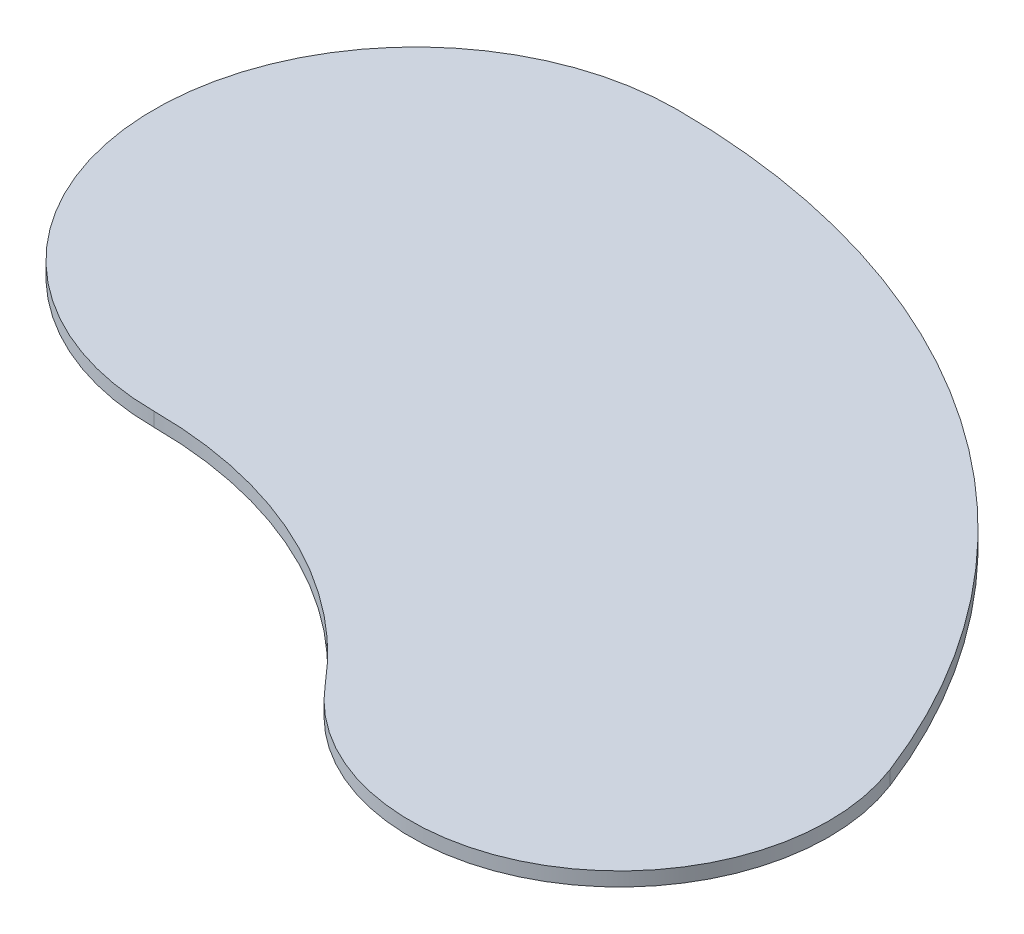
ISO-10303-21;
HEADER;
FILE_DESCRIPTION(('STEP AP214'),'2;1');
FILE_NAME('part.step','',(''),(''),'','','');
FILE_SCHEMA(('AUTOMOTIVE_DESIGN { 1 0 10303 214 1 1 1 1 }'));
ENDSEC;
DATA;
#1=APPLICATION_CONTEXT('core data for automotive mechanical design processes');
#2=APPLICATION_PROTOCOL_DEFINITION('international standard','automotive_design',2000,#1);
#3=PRODUCT_CONTEXT('',#1,'mechanical');
#4=PRODUCT('Part','Part','',(#3));
#5=PRODUCT_RELATED_PRODUCT_CATEGORY('part','',(#4));
#6=PRODUCT_DEFINITION_FORMATION('','',#4);
#7=PRODUCT_DEFINITION_CONTEXT('part definition',#1,'design');
#8=PRODUCT_DEFINITION('design','',#6,#7);
#9=PRODUCT_DEFINITION_SHAPE('','',#8);
#10=(LENGTH_UNIT() NAMED_UNIT(*) SI_UNIT(.MILLI.,.METRE.));
#11=(NAMED_UNIT(*) PLANE_ANGLE_UNIT() SI_UNIT($,.RADIAN.));
#12=(NAMED_UNIT(*) SI_UNIT($,.STERADIAN.) SOLID_ANGLE_UNIT());
#13=UNCERTAINTY_MEASURE_WITH_UNIT(LENGTH_MEASURE(1.E-05),#10,'distance_accuracy_value','');
#14=(GEOMETRIC_REPRESENTATION_CONTEXT(3) GLOBAL_UNCERTAINTY_ASSIGNED_CONTEXT((#13)) GLOBAL_UNIT_ASSIGNED_CONTEXT((#10,
#11,#12)) REPRESENTATION_CONTEXT('',''));
#15=CARTESIAN_POINT('',(0.,0.,0.));
#16=DIRECTION('',(0.,0.,1.));
#17=DIRECTION('',(1.,0.,0.));
#18=AXIS2_PLACEMENT_3D('',#15,#16,#17);
#19=CARTESIAN_POINT('',(0.,2.54,-16.7940789473687));
#20=DIRECTION('',(0.,-1.,0.));
#21=DIRECTION('',(0.,0.,-1.));
#22=AXIS2_PLACEMENT_3D('',#19,#20,#21);
#23=CYLINDRICAL_SURFACE('',#22,132.430921052631);
#24=CARTESIAN_POINT('',(0.,0.,-16.7940789473687));
#25=DIRECTION('',(0.,-1.,0.));
#26=DIRECTION('',(0.,0.,-1.));
#27=AXIS2_PLACEMENT_3D('',#24,#25,#26);
#28=CIRCLE('',#27,132.430921052631);
#29=CARTESIAN_POINT('',(0.,0.,-149.225));
#30=VERTEX_POINT('',#29);
#31=CARTESIAN_POINT('',(123.526365742985,0.,-64.5348981399474));
#32=VERTEX_POINT('',#31);
#33=EDGE_CURVE('E120',#30,#32,#28,.T.);
#34=ORIENTED_EDGE('',*,*,#33,.F.);
#35=DIRECTION('',(0.,-1.,0.));
#36=VECTOR('',#35,1.);
#37=CARTESIAN_POINT('',(0.,2.54,-149.225));
#38=LINE('',#37,#36);
#39=CARTESIAN_POINT('',(0.,2.54,-149.225));
#40=VERTEX_POINT('',#39);
#41=EDGE_CURVE('E12',#40,#30,#38,.T.);
#42=ORIENTED_EDGE('',*,*,#41,.F.);
#43=CARTESIAN_POINT('',(0.,2.54,-16.7940789473687));
#44=DIRECTION('',(0.,-1.,0.));
#45=DIRECTION('',(0.,0.,-1.));
#46=AXIS2_PLACEMENT_3D('',#43,#44,#45);
#47=CIRCLE('',#46,132.430921052631);
#48=CARTESIAN_POINT('',(123.526365742985,2.54,-64.5348981399474));
#49=VERTEX_POINT('',#48);
#50=EDGE_CURVE('E108',#40,#49,#47,.T.);
#51=ORIENTED_EDGE('',*,*,#50,.T.);
#52=DIRECTION('',(0.,-1.,0.));
#53=VECTOR('',#52,1.);
#54=CARTESIAN_POINT('',(123.526365742985,2.54,-64.5348981399474));
#55=LINE('',#54,#53);
#56=EDGE_CURVE('E47',#49,#32,#55,.T.);
#57=ORIENTED_EDGE('',*,*,#56,.T.);
#58=EDGE_LOOP('',(#34,#42,#51,#57));
#59=FACE_BOUND('',#58,.T.);
#60=ADVANCED_FACE('F44',(#59),#23,.T.);
#61=CARTESIAN_POINT('',(0.,2.54,-101.6));
#62=DIRECTION('',(0.,-1.,0.));
#63=DIRECTION('',(0.,0.,-1.));
#64=AXIS2_PLACEMENT_3D('',#61,#62,#63);
#65=CYLINDRICAL_SURFACE('',#64,47.625);
#66=CARTESIAN_POINT('',(0.,0.,-101.6));
#67=DIRECTION('',(0.,1.,0.));
#68=DIRECTION('',(0.,0.,1.));
#69=AXIS2_PLACEMENT_3D('',#66,#67,#68);
#70=CIRCLE('',#69,47.625);
#71=CARTESIAN_POINT('',(0.,0.,-53.975));
#72=VERTEX_POINT('',#71);
#73=EDGE_CURVE('E78',#30,#72,#70,.T.);
#74=ORIENTED_EDGE('',*,*,#73,.T.);
#75=DIRECTION('',(0.,-1.,0.));
#76=VECTOR('',#75,1.);
#77=CARTESIAN_POINT('',(0.,2.54,-53.975));
#78=LINE('',#77,#76);
#79=CARTESIAN_POINT('',(0.,2.54,-53.975));
#80=VERTEX_POINT('',#79);
#81=EDGE_CURVE('E54',#80,#72,#78,.T.);
#82=ORIENTED_EDGE('',*,*,#81,.F.);
#83=CARTESIAN_POINT('',(0.,2.54,-101.6));
#84=DIRECTION('',(0.,1.,0.));
#85=DIRECTION('',(0.,0.,1.));
#86=AXIS2_PLACEMENT_3D('',#83,#84,#85);
#87=CIRCLE('',#86,47.625);
#88=EDGE_CURVE('E93',#40,#80,#87,.T.);
#89=ORIENTED_EDGE('',*,*,#88,.F.);
#90=ORIENTED_EDGE('',*,*,#41,.T.);
#91=EDGE_LOOP('',(#74,#82,#89,#90));
#92=FACE_BOUND('',#91,.T.);
#93=ADVANCED_FACE('F136',(#92),#65,.T.);
#94=CARTESIAN_POINT('',(0.,2.54,22.3471153846156));
#95=DIRECTION('',(0.,-1.,0.));
#96=DIRECTION('',(0.,0.,-1.));
#97=AXIS2_PLACEMENT_3D('',#94,#95,#96);
#98=CYLINDRICAL_SURFACE('',#97,76.3221153846156);
#99=CARTESIAN_POINT('',(0.,0.,22.3471153846156));
#100=DIRECTION('',(0.,-1.,0.));
#101=DIRECTION('',(0.,0.,-1.));
#102=AXIS2_PLACEMENT_3D('',#99,#100,#101);
#103=CIRCLE('',#102,76.3221153846156);
#104=CARTESIAN_POINT('',(58.6900887303221,0.,-26.4436499466385));
#105=VERTEX_POINT('',#104);
#106=EDGE_CURVE('E101',#72,#105,#103,.T.);
#107=ORIENTED_EDGE('',*,*,#106,.T.);
#108=DIRECTION('',(0.,-1.,0.));
#109=VECTOR('',#108,1.);
#110=CARTESIAN_POINT('',(58.6900887303221,2.54,-26.4436499466385));
#111=LINE('',#110,#109);
#112=CARTESIAN_POINT('',(58.6900887303221,2.54,-26.4436499466385));
#113=VERTEX_POINT('',#112);
#114=EDGE_CURVE('E98',#113,#105,#111,.T.);
#115=ORIENTED_EDGE('',*,*,#114,.F.);
#116=CARTESIAN_POINT('',(0.,2.54,22.3471153846156));
#117=DIRECTION('',(0.,-1.,0.));
#118=DIRECTION('',(0.,0.,-1.));
#119=AXIS2_PLACEMENT_3D('',#116,#117,#118);
#120=CIRCLE('',#119,76.3221153846156);
#121=EDGE_CURVE('E90',#80,#113,#120,.T.);
#122=ORIENTED_EDGE('',*,*,#121,.F.);
#123=ORIENTED_EDGE('',*,*,#81,.T.);
#124=EDGE_LOOP('',(#107,#115,#122,#123));
#125=FACE_BOUND('',#124,.T.);
#126=ADVANCED_FACE('F99',(#125),#98,.F.);
#127=CARTESIAN_POINT('',(87.9881810244987,2.54,-50.8000000000005));
#128=DIRECTION('',(0.,-1.,0.));
#129=DIRECTION('',(0.,0.,-1.));
#130=AXIS2_PLACEMENT_3D('',#127,#128,#129);
#131=CYLINDRICAL_SURFACE('',#130,38.1);
#132=CARTESIAN_POINT('',(87.9881810244987,0.,-50.8000000000005));
#133=DIRECTION('',(0.,1.,0.));
#134=DIRECTION('',(0.,0.,1.));
#135=AXIS2_PLACEMENT_3D('',#132,#133,#134);
#136=CIRCLE('',#135,38.1);
#137=EDGE_CURVE('E124',#105,#32,#136,.T.);
#138=ORIENTED_EDGE('',*,*,#137,.T.);
#139=ORIENTED_EDGE('',*,*,#56,.F.);
#140=CARTESIAN_POINT('',(87.9881810244987,2.54,-50.8000000000005));
#141=DIRECTION('',(0.,1.,0.));
#142=DIRECTION('',(0.,0.,1.));
#143=AXIS2_PLACEMENT_3D('',#140,#141,#142);
#144=CIRCLE('',#143,38.1);
#145=EDGE_CURVE('E87',#113,#49,#144,.T.);
#146=ORIENTED_EDGE('',*,*,#145,.F.);
#147=ORIENTED_EDGE('',*,*,#114,.T.);
#148=EDGE_LOOP('',(#138,#139,#146,#147));
#149=FACE_BOUND('',#148,.T.);
#150=ADVANCED_FACE('F106',(#149),#131,.T.);
#151=CARTESIAN_POINT('',(43.9940905122494,2.54,-33.7970394736845));
#152=DIRECTION('',(0.,-1.,0.));
#153=DIRECTION('',(0.,0.,-1.));
#154=AXIS2_PLACEMENT_3D('',#151,#152,#153);
#155=PLANE('',#154);
#156=ORIENTED_EDGE('',*,*,#50,.F.);
#157=ORIENTED_EDGE('',*,*,#88,.T.);
#158=ORIENTED_EDGE('',*,*,#121,.T.);
#159=ORIENTED_EDGE('',*,*,#145,.T.);
#160=EDGE_LOOP('',(#156,#157,#158,#159));
#161=FACE_BOUND('',#160,.T.);
#162=ADVANCED_FACE('F92',(#161),#155,.F.);
#163=CARTESIAN_POINT('',(43.9940905122494,0.,-33.7970394736845));
#164=DIRECTION('',(0.,-1.,0.));
#165=DIRECTION('',(0.,0.,-1.));
#166=AXIS2_PLACEMENT_3D('',#163,#164,#165);
#167=PLANE('',#166);
#168=ORIENTED_EDGE('',*,*,#33,.T.);
#169=ORIENTED_EDGE('',*,*,#137,.F.);
#170=ORIENTED_EDGE('',*,*,#106,.F.);
#171=ORIENTED_EDGE('',*,*,#73,.F.);
#172=EDGE_LOOP('',(#168,#169,#170,#171));
#173=FACE_BOUND('',#172,.T.);
#174=ADVANCED_FACE('F133',(#173),#167,.T.);
#175=CLOSED_SHELL('',(#60,#93,#126,#150,#162,#174));
#176=MANIFOLD_SOLID_BREP('B2',#175);
#177=ADVANCED_BREP_SHAPE_REPRESENTATION('',(#18,#176),#14);
#178=SHAPE_DEFINITION_REPRESENTATION(#9,#177);
ENDSEC;
END-ISO-10303-21;
